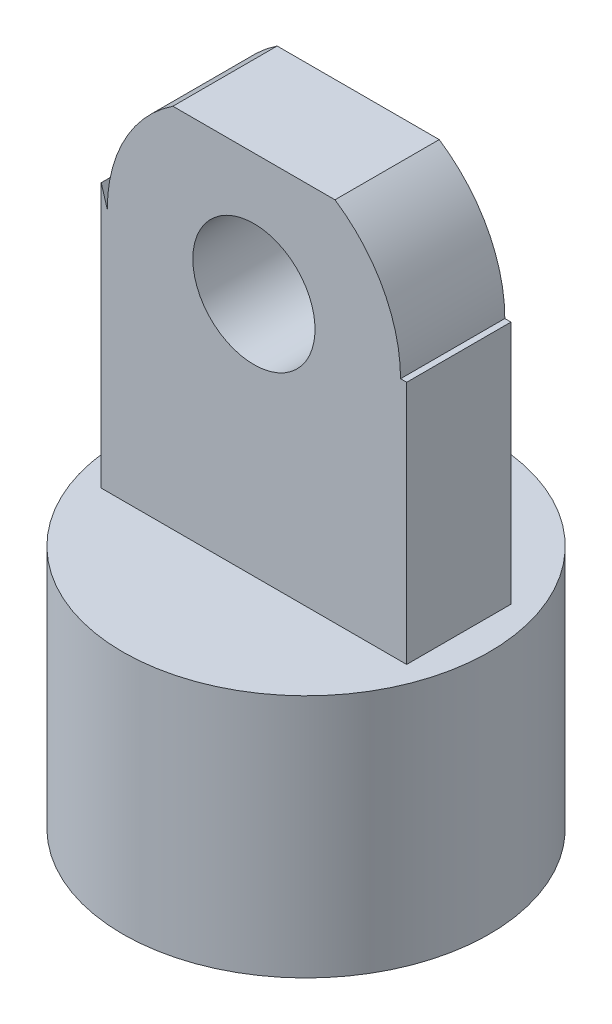
ISO-10303-21;
HEADER;
FILE_DESCRIPTION(('STEP AP214'),'2;1');
FILE_NAME('part.step','',(''),(''),'','','');
FILE_SCHEMA(('AUTOMOTIVE_DESIGN { 1 0 10303 214 1 1 1 1 }'));
ENDSEC;
DATA;
#1=APPLICATION_CONTEXT('core data for automotive mechanical design processes');
#2=APPLICATION_PROTOCOL_DEFINITION('international standard','automotive_design',2000,#1);
#3=PRODUCT_CONTEXT('',#1,'mechanical');
#4=PRODUCT('Part','Part','',(#3));
#5=PRODUCT_RELATED_PRODUCT_CATEGORY('part','',(#4));
#6=PRODUCT_DEFINITION_FORMATION('','',#4);
#7=PRODUCT_DEFINITION_CONTEXT('part definition',#1,'design');
#8=PRODUCT_DEFINITION('design','',#6,#7);
#9=PRODUCT_DEFINITION_SHAPE('','',#8);
#10=(LENGTH_UNIT() NAMED_UNIT(*) SI_UNIT(.MILLI.,.METRE.));
#11=(NAMED_UNIT(*) PLANE_ANGLE_UNIT() SI_UNIT($,.RADIAN.));
#12=(NAMED_UNIT(*) SI_UNIT($,.STERADIAN.) SOLID_ANGLE_UNIT());
#13=UNCERTAINTY_MEASURE_WITH_UNIT(LENGTH_MEASURE(1.E-05),#10,'distance_accuracy_value','');
#14=(GEOMETRIC_REPRESENTATION_CONTEXT(3) GLOBAL_UNCERTAINTY_ASSIGNED_CONTEXT((#13)) GLOBAL_UNIT_ASSIGNED_CONTEXT((#10,
#11,#12)) REPRESENTATION_CONTEXT('',''));
#15=CARTESIAN_POINT('',(0.,0.,0.));
#16=DIRECTION('',(0.,0.,1.));
#17=DIRECTION('',(1.,0.,0.));
#18=AXIS2_PLACEMENT_3D('',#15,#16,#17);
#19=CARTESIAN_POINT('',(0.,20.,0.));
#20=DIRECTION('',(0.,1.,0.));
#21=DIRECTION('',(0.,0.,1.));
#22=AXIS2_PLACEMENT_3D('',#19,#20,#21);
#23=PLANE('',#22);
#24=CARTESIAN_POINT('',(0.,20.,0.));
#25=DIRECTION('',(0.,1.,0.));
#26=DIRECTION('',(0.,0.,1.));
#27=AXIS2_PLACEMENT_3D('',#24,#25,#26);
#28=CIRCLE('',#27,15.);
#29=CARTESIAN_POINT('',(0.,20.,15.));
#30=VERTEX_POINT('',#29);
#31=EDGE_CURVE('E181',#30,#30,#28,.T.);
#32=ORIENTED_EDGE('',*,*,#31,.T.);
#33=EDGE_LOOP('',(#32));
#34=FACE_BOUND('',#33,.T.);
#35=DIRECTION('',(1.,0.,0.));
#36=VECTOR('',#35,1.);
#37=CARTESIAN_POINT('',(12.5,20.,4.26695525061405));
#38=LINE('',#37,#36);
#39=CARTESIAN_POINT('',(-12.5,20.,4.26695525061405));
#40=VERTEX_POINT('',#39);
#41=CARTESIAN_POINT('',(12.5,20.,4.26695525061405));
#42=VERTEX_POINT('',#41);
#43=EDGE_CURVE('E163',#40,#42,#38,.T.);
#44=ORIENTED_EDGE('',*,*,#43,.F.);
#45=DIRECTION('',(0.,0.,1.));
#46=VECTOR('',#45,1.);
#47=CARTESIAN_POINT('',(-12.5,20.,4.26695525061405));
#48=LINE('',#47,#46);
#49=CARTESIAN_POINT('',(-12.5,20.,-4.26695525061404));
#50=VERTEX_POINT('',#49);
#51=EDGE_CURVE('E154',#50,#40,#48,.T.);
#52=ORIENTED_EDGE('',*,*,#51,.F.);
#53=DIRECTION('',(-1.,0.,0.));
#54=VECTOR('',#53,1.);
#55=CARTESIAN_POINT('',(12.5,20.,-4.26695525061405));
#56=LINE('',#55,#54);
#57=CARTESIAN_POINT('',(12.5,20.,-4.26695525061405));
#58=VERTEX_POINT('',#57);
#59=EDGE_CURVE('E159',#58,#50,#56,.T.);
#60=ORIENTED_EDGE('',*,*,#59,.F.);
#61=DIRECTION('',(0.,0.,-1.));
#62=VECTOR('',#61,1.);
#63=CARTESIAN_POINT('',(12.5,20.,4.26695525061405));
#64=LINE('',#63,#62);
#65=EDGE_CURVE('E166',#42,#58,#64,.T.);
#66=ORIENTED_EDGE('',*,*,#65,.F.);
#67=EDGE_LOOP('',(#44,#52,#60,#66));
#68=FACE_BOUND('',#67,.T.);
#69=ADVANCED_FACE('F45',(#34,#68),#23,.T.);
#70=CARTESIAN_POINT('',(0.,20.,0.));
#71=DIRECTION('',(0.,-1.,0.));
#72=DIRECTION('',(0.,0.,-1.));
#73=AXIS2_PLACEMENT_3D('',#70,#71,#72);
#74=CYLINDRICAL_SURFACE('',#73,15.);
#75=ORIENTED_EDGE('',*,*,#31,.F.);
#76=EDGE_LOOP('',(#75));
#77=FACE_BOUND('',#76,.T.);
#78=CARTESIAN_POINT('',(0.,0.,0.));
#79=DIRECTION('',(0.,1.,0.));
#80=DIRECTION('',(0.,0.,1.));
#81=AXIS2_PLACEMENT_3D('',#78,#79,#80);
#82=CIRCLE('',#81,15.);
#83=CARTESIAN_POINT('',(0.,0.,15.));
#84=VERTEX_POINT('',#83);
#85=EDGE_CURVE('E180',#84,#84,#82,.T.);
#86=ORIENTED_EDGE('',*,*,#85,.T.);
#87=EDGE_LOOP('',(#86));
#88=FACE_BOUND('',#87,.T.);
#89=ADVANCED_FACE('F47',(#77,#88),#74,.T.);
#90=CARTESIAN_POINT('',(0.,0.,0.));
#91=DIRECTION('',(0.,1.,0.));
#92=DIRECTION('',(0.,0.,1.));
#93=AXIS2_PLACEMENT_3D('',#90,#91,#92);
#94=PLANE('',#93);
#95=CARTESIAN_POINT('',(0.,0.,0.));
#96=DIRECTION('',(0.,-1.,0.));
#97=DIRECTION('',(0.,0.,-1.));
#98=AXIS2_PLACEMENT_3D('',#95,#96,#97);
#99=CIRCLE('',#98,7.5);
#100=CARTESIAN_POINT('',(0.,0.,-7.5));
#101=VERTEX_POINT('',#100);
#102=EDGE_CURVE('E177',#101,#101,#99,.T.);
#103=ORIENTED_EDGE('',*,*,#102,.F.);
#104=EDGE_LOOP('',(#103));
#105=FACE_BOUND('',#104,.T.);
#106=ORIENTED_EDGE('',*,*,#85,.F.);
#107=EDGE_LOOP('',(#106));
#108=FACE_BOUND('',#107,.T.);
#109=ADVANCED_FACE('F188',(#105,#108),#94,.F.);
#110=CARTESIAN_POINT('',(-12.5,50.,4.26695525061405));
#111=DIRECTION('',(1.,0.,0.));
#112=DIRECTION('',(0.,0.,-1.));
#113=AXIS2_PLACEMENT_3D('',#110,#111,#112);
#114=PLANE('',#113);
#115=DIRECTION('',(0.,-1.,0.));
#116=VECTOR('',#115,1.);
#117=CARTESIAN_POINT('',(-12.5,50.,4.26695525061405));
#118=LINE('',#117,#116);
#119=CARTESIAN_POINT('',(-12.5,41.6460869681389,4.26695525061405));
#120=VERTEX_POINT('',#119);
#121=EDGE_CURVE('E175',#120,#40,#118,.T.);
#122=ORIENTED_EDGE('',*,*,#121,.F.);
#123=DIRECTION('',(0.,0.,-1.));
#124=VECTOR('',#123,1.);
#125=CARTESIAN_POINT('',(-12.5,41.6460869681389,4.26695525061405));
#126=LINE('',#125,#124);
#127=CARTESIAN_POINT('',(-12.5,41.6460869681388,-4.26695525061404));
#128=VERTEX_POINT('',#127);
#129=EDGE_CURVE('E140',#120,#128,#126,.T.);
#130=ORIENTED_EDGE('',*,*,#129,.T.);
#131=DIRECTION('',(0.,-1.,0.));
#132=VECTOR('',#131,1.);
#133=CARTESIAN_POINT('',(-12.5,50.,-4.26695525061404));
#134=LINE('',#133,#132);
#135=EDGE_CURVE('E130',#128,#50,#134,.T.);
#136=ORIENTED_EDGE('',*,*,#135,.T.);
#137=ORIENTED_EDGE('',*,*,#51,.T.);
#138=EDGE_LOOP('',(#122,#130,#136,#137));
#139=FACE_BOUND('',#138,.T.);
#140=ADVANCED_FACE('F190',(#139),#114,.F.);
#141=CARTESIAN_POINT('',(12.5,50.,4.26695525061405));
#142=DIRECTION('',(0.,0.,-1.));
#143=DIRECTION('',(-1.,0.,0.));
#144=AXIS2_PLACEMENT_3D('',#141,#142,#143);
#145=PLANE('',#144);
#146=CARTESIAN_POINT('',(0.,40.,4.26695525061405));
#147=DIRECTION('',(0.,0.,-1.));
#148=DIRECTION('',(-1.,0.,0.));
#149=AXIS2_PLACEMENT_3D('',#146,#147,#148);
#150=CIRCLE('',#149,5.00000000000001);
#151=CARTESIAN_POINT('',(-5.00000000000001,40.,4.26695525061405));
#152=VERTEX_POINT('',#151);
#153=EDGE_CURVE('E151',#152,#152,#150,.T.);
#154=ORIENTED_EDGE('',*,*,#153,.T.);
#155=EDGE_LOOP('',(#154));
#156=FACE_BOUND('',#155,.T.);
#157=DIRECTION('',(-1.,0.,0.));
#158=VECTOR('',#157,1.);
#159=CARTESIAN_POINT('',(12.5,40.,4.26695525061405));
#160=LINE('',#159,#158);
#161=CARTESIAN_POINT('',(12.5,40.,4.26695525061405));
#162=VERTEX_POINT('',#161);
#163=CARTESIAN_POINT('',(12.,40.,4.26695525061405));
#164=VERTEX_POINT('',#163);
#165=EDGE_CURVE('E145',#162,#164,#160,.T.);
#166=ORIENTED_EDGE('',*,*,#165,.T.);
#167=CARTESIAN_POINT('',(0.,40.,4.26695525061405));
#168=DIRECTION('',(0.,0.,-1.));
#169=DIRECTION('',(-1.,0.,0.));
#170=AXIS2_PLACEMENT_3D('',#167,#168,#169);
#171=CIRCLE('',#170,12.);
#172=CARTESIAN_POINT('',(6.63324958071078,50.,4.26695525061405));
#173=VERTEX_POINT('',#172);
#174=EDGE_CURVE('E138',#164,#173,#171,.F.);
#175=ORIENTED_EDGE('',*,*,#174,.T.);
#176=DIRECTION('',(1.,0.,0.));
#177=VECTOR('',#176,1.);
#178=CARTESIAN_POINT('',(12.5,50.,4.26695525061405));
#179=LINE('',#178,#177);
#180=CARTESIAN_POINT('',(-6.63324958071079,50.,4.26695525061405));
#181=VERTEX_POINT('',#180);
#182=EDGE_CURVE('E155',#181,#173,#179,.T.);
#183=ORIENTED_EDGE('',*,*,#182,.F.);
#184=CARTESIAN_POINT('',(-12.,40.,4.26695525061405));
#185=VERTEX_POINT('',#184);
#186=EDGE_CURVE('E67',#181,#185,#171,.F.);
#187=ORIENTED_EDGE('',*,*,#186,.T.);
#188=DIRECTION('',(-0.29063862201532,0.956832896274494,0.));
#189=VECTOR('',#188,1.);
#190=CARTESIAN_POINT('',(-12.7113911338508,42.3420233493628,4.26695525061405));
#191=LINE('',#190,#189);
#192=EDGE_CURVE('E115',#185,#120,#191,.T.);
#193=ORIENTED_EDGE('',*,*,#192,.T.);
#194=ORIENTED_EDGE('',*,*,#121,.T.);
#195=ORIENTED_EDGE('',*,*,#43,.T.);
#196=DIRECTION('',(0.,-1.,0.));
#197=VECTOR('',#196,1.);
#198=CARTESIAN_POINT('',(12.5,50.,4.26695525061405));
#199=LINE('',#198,#197);
#200=EDGE_CURVE('E173',#162,#42,#199,.T.);
#201=ORIENTED_EDGE('',*,*,#200,.F.);
#202=EDGE_LOOP('',(#166,#175,#183,#187,#193,#194,#195,#201));
#203=FACE_BOUND('',#202,.T.);
#204=ADVANCED_FACE('F196',(#156,#203),#145,.F.);
#205=CARTESIAN_POINT('',(12.5,50.,4.26695525061405));
#206=DIRECTION('',(-1.,0.,0.));
#207=DIRECTION('',(0.,0.,1.));
#208=AXIS2_PLACEMENT_3D('',#205,#206,#207);
#209=PLANE('',#208);
#210=DIRECTION('',(0.,-1.,0.));
#211=VECTOR('',#210,1.);
#212=CARTESIAN_POINT('',(12.5,50.,-4.26695525061405));
#213=LINE('',#212,#211);
#214=CARTESIAN_POINT('',(12.5,40.,-4.26695525061405));
#215=VERTEX_POINT('',#214);
#216=EDGE_CURVE('E171',#215,#58,#213,.T.);
#217=ORIENTED_EDGE('',*,*,#216,.F.);
#218=DIRECTION('',(0.,0.,1.));
#219=VECTOR('',#218,1.);
#220=CARTESIAN_POINT('',(12.5,40.,4.26695525061405));
#221=LINE('',#220,#219);
#222=EDGE_CURVE('E142',#215,#162,#221,.T.);
#223=ORIENTED_EDGE('',*,*,#222,.T.);
#224=ORIENTED_EDGE('',*,*,#200,.T.);
#225=ORIENTED_EDGE('',*,*,#65,.T.);
#226=EDGE_LOOP('',(#217,#223,#224,#225));
#227=FACE_BOUND('',#226,.T.);
#228=ADVANCED_FACE('F210',(#227),#209,.F.);
#229=CARTESIAN_POINT('',(12.5,50.,-4.26695525061405));
#230=DIRECTION('',(0.,0.,1.));
#231=DIRECTION('',(1.,0.,0.));
#232=AXIS2_PLACEMENT_3D('',#229,#230,#231);
#233=PLANE('',#232);
#234=CARTESIAN_POINT('',(0.,40.,-4.26695525061404));
#235=DIRECTION('',(0.,0.,-1.));
#236=DIRECTION('',(-1.,0.,0.));
#237=AXIS2_PLACEMENT_3D('',#234,#235,#236);
#238=CIRCLE('',#237,5.00000000000001);
#239=CARTESIAN_POINT('',(-5.00000000000001,40.,-4.26695525061404));
#240=VERTEX_POINT('',#239);
#241=EDGE_CURVE('E148',#240,#240,#238,.T.);
#242=ORIENTED_EDGE('',*,*,#241,.F.);
#243=EDGE_LOOP('',(#242));
#244=FACE_BOUND('',#243,.T.);
#245=DIRECTION('',(-1.,0.,0.));
#246=VECTOR('',#245,1.);
#247=CARTESIAN_POINT('',(12.5,50.,-4.26695525061405));
#248=LINE('',#247,#246);
#249=CARTESIAN_POINT('',(6.63324958071078,50.,-4.26695525061405));
#250=VERTEX_POINT('',#249);
#251=CARTESIAN_POINT('',(-6.63324958071079,50.,-4.26695525061404));
#252=VERTEX_POINT('',#251);
#253=EDGE_CURVE('E158',#250,#252,#248,.T.);
#254=ORIENTED_EDGE('',*,*,#253,.F.);
#255=CARTESIAN_POINT('',(0.,40.,-4.26695525061404));
#256=DIRECTION('',(0.,0.,1.));
#257=DIRECTION('',(-1.,0.,0.));
#258=AXIS2_PLACEMENT_3D('',#255,#256,#257);
#259=CIRCLE('',#258,12.);
#260=CARTESIAN_POINT('',(12.,40.,-4.26695525061405));
#261=VERTEX_POINT('',#260);
#262=EDGE_CURVE('E59',#261,#250,#259,.T.);
#263=ORIENTED_EDGE('',*,*,#262,.F.);
#264=DIRECTION('',(-1.,0.,0.));
#265=VECTOR('',#264,1.);
#266=CARTESIAN_POINT('',(12.,40.,-4.26695525061405));
#267=LINE('',#266,#265);
#268=EDGE_CURVE('E117',#215,#261,#267,.T.);
#269=ORIENTED_EDGE('',*,*,#268,.F.);
#270=ORIENTED_EDGE('',*,*,#216,.T.);
#271=ORIENTED_EDGE('',*,*,#59,.T.);
#272=ORIENTED_EDGE('',*,*,#135,.F.);
#273=DIRECTION('',(-0.29063862201532,0.956832896274494,0.));
#274=VECTOR('',#273,1.);
#275=CARTESIAN_POINT('',(-20.699554593314,68.6404468893329,-4.26695525061404));
#276=LINE('',#275,#274);
#277=CARTESIAN_POINT('',(-12.,40.,-4.26695525061404));
#278=VERTEX_POINT('',#277);
#279=EDGE_CURVE('E112',#278,#128,#276,.T.);
#280=ORIENTED_EDGE('',*,*,#279,.F.);
#281=EDGE_CURVE('E120',#252,#278,#259,.T.);
#282=ORIENTED_EDGE('',*,*,#281,.F.);
#283=EDGE_LOOP('',(#254,#263,#269,#270,#271,#272,#280,#282));
#284=FACE_BOUND('',#283,.T.);
#285=ADVANCED_FACE('F128',(#244,#284),#233,.F.);
#286=CARTESIAN_POINT('',(0.,50.,0.));
#287=DIRECTION('',(0.,1.,0.));
#288=DIRECTION('',(0.,0.,1.));
#289=AXIS2_PLACEMENT_3D('',#286,#287,#288);
#290=PLANE('',#289);
#291=DIRECTION('',(0.,0.,-1.));
#292=VECTOR('',#291,1.);
#293=CARTESIAN_POINT('',(6.63324958071078,50.,25.733044749386));
#294=LINE('',#293,#292);
#295=EDGE_CURVE('E13',#250,#173,#294,.F.);
#296=ORIENTED_EDGE('',*,*,#295,.F.);
#297=ORIENTED_EDGE('',*,*,#253,.T.);
#298=DIRECTION('',(0.,0.,-1.));
#299=VECTOR('',#298,1.);
#300=CARTESIAN_POINT('',(-6.63324958071079,50.,25.733044749386));
#301=LINE('',#300,#299);
#302=EDGE_CURVE('E53',#181,#252,#301,.T.);
#303=ORIENTED_EDGE('',*,*,#302,.F.);
#304=ORIENTED_EDGE('',*,*,#182,.T.);
#305=EDGE_LOOP('',(#296,#297,#303,#304));
#306=FACE_BOUND('',#305,.T.);
#307=ADVANCED_FACE('F217',(#306),#290,.T.);
#308=CARTESIAN_POINT('',(0.,40.,25.733044749386));
#309=DIRECTION('',(0.,0.,-1.));
#310=DIRECTION('',(-1.,0.,0.));
#311=AXIS2_PLACEMENT_3D('',#308,#309,#310);
#312=CYLINDRICAL_SURFACE('',#311,5.00000000000001);
#313=ORIENTED_EDGE('',*,*,#241,.T.);
#314=EDGE_LOOP('',(#313));
#315=FACE_BOUND('',#314,.T.);
#316=ORIENTED_EDGE('',*,*,#153,.F.);
#317=EDGE_LOOP('',(#316));
#318=FACE_BOUND('',#317,.T.);
#319=ADVANCED_FACE('F221',(#315,#318),#312,.F.);
#320=CARTESIAN_POINT('',(0.,40.,25.733044749386));
#321=DIRECTION('',(0.,0.,-1.));
#322=DIRECTION('',(-1.,0.,0.));
#323=AXIS2_PLACEMENT_3D('',#320,#321,#322);
#324=CYLINDRICAL_SURFACE('',#323,12.);
#325=ORIENTED_EDGE('',*,*,#302,.T.);
#326=ORIENTED_EDGE('',*,*,#281,.T.);
#327=DIRECTION('',(0.,0.,-1.));
#328=VECTOR('',#327,1.);
#329=CARTESIAN_POINT('',(-12.,40.,25.733044749386));
#330=LINE('',#329,#328);
#331=EDGE_CURVE('E108',#185,#278,#330,.T.);
#332=ORIENTED_EDGE('',*,*,#331,.F.);
#333=ORIENTED_EDGE('',*,*,#186,.F.);
#334=EDGE_LOOP('',(#325,#326,#332,#333));
#335=FACE_BOUND('',#334,.T.);
#336=ADVANCED_FACE('F121',(#335),#324,.T.);
#337=CARTESIAN_POINT('',(-20.699554593314,68.6404468893329,25.733044749386));
#338=DIRECTION('',(-0.956832896274494,-0.29063862201532,0.));
#339=DIRECTION('',(0.29063862201532,-0.956832896274494,0.));
#340=AXIS2_PLACEMENT_3D('',#337,#338,#339);
#341=PLANE('',#340);
#342=ORIENTED_EDGE('',*,*,#192,.F.);
#343=ORIENTED_EDGE('',*,*,#331,.T.);
#344=ORIENTED_EDGE('',*,*,#279,.T.);
#345=ORIENTED_EDGE('',*,*,#129,.F.);
#346=EDGE_LOOP('',(#342,#343,#344,#345));
#347=FACE_BOUND('',#346,.T.);
#348=ADVANCED_FACE('F110',(#347),#341,.F.);
#349=CARTESIAN_POINT('',(12.,40.,25.733044749386));
#350=DIRECTION('',(0.,-1.,0.));
#351=DIRECTION('',(0.,0.,-1.));
#352=AXIS2_PLACEMENT_3D('',#349,#350,#351);
#353=PLANE('',#352);
#354=ORIENTED_EDGE('',*,*,#222,.F.);
#355=ORIENTED_EDGE('',*,*,#268,.T.);
#356=DIRECTION('',(0.,0.,-1.));
#357=VECTOR('',#356,1.);
#358=CARTESIAN_POINT('',(12.,40.,25.733044749386));
#359=LINE('',#358,#357);
#360=EDGE_CURVE('E116',#164,#261,#359,.T.);
#361=ORIENTED_EDGE('',*,*,#360,.F.);
#362=ORIENTED_EDGE('',*,*,#165,.F.);
#363=EDGE_LOOP('',(#354,#355,#361,#362));
#364=FACE_BOUND('',#363,.T.);
#365=ADVANCED_FACE('F230',(#364),#353,.F.);
#366=ORIENTED_EDGE('',*,*,#360,.T.);
#367=ORIENTED_EDGE('',*,*,#262,.T.);
#368=ORIENTED_EDGE('',*,*,#295,.T.);
#369=ORIENTED_EDGE('',*,*,#174,.F.);
#370=EDGE_LOOP('',(#366,#367,#368,#369));
#371=FACE_BOUND('',#370,.T.);
#372=ADVANCED_FACE('F226',(#371),#324,.T.);
#373=CARTESIAN_POINT('',(0.,-5.,0.));
#374=DIRECTION('',(0.,1.,0.));
#375=DIRECTION('',(0.,0.,1.));
#376=AXIS2_PLACEMENT_3D('',#373,#374,#375);
#377=CYLINDRICAL_SURFACE('',#376,7.5);
#378=CARTESIAN_POINT('',(0.,-5.,0.));
#379=DIRECTION('',(0.,-1.,0.));
#380=DIRECTION('',(0.,0.,-1.));
#381=AXIS2_PLACEMENT_3D('',#378,#379,#380);
#382=CIRCLE('',#381,7.5);
#383=CARTESIAN_POINT('',(0.,-5.,-7.5));
#384=VERTEX_POINT('',#383);
#385=EDGE_CURVE('E125',#384,#384,#382,.T.);
#386=ORIENTED_EDGE('',*,*,#385,.F.);
#387=EDGE_LOOP('',(#386));
#388=FACE_BOUND('',#387,.T.);
#389=ORIENTED_EDGE('',*,*,#102,.T.);
#390=EDGE_LOOP('',(#389));
#391=FACE_BOUND('',#390,.T.);
#392=ADVANCED_FACE('F229',(#388,#391),#377,.T.);
#393=CARTESIAN_POINT('',(0.,-5.,0.));
#394=DIRECTION('',(0.,-1.,0.));
#395=DIRECTION('',(0.,0.,-1.));
#396=AXIS2_PLACEMENT_3D('',#393,#394,#395);
#397=PLANE('',#396);
#398=ORIENTED_EDGE('',*,*,#385,.T.);
#399=EDGE_LOOP('',(#398));
#400=FACE_BOUND('',#399,.T.);
#401=ADVANCED_FACE('F238',(#400),#397,.T.);
#402=CLOSED_SHELL('',(#69,#89,#109,#140,#204,#228,#285,#307,#319,#336,#348,#365,#372,#392,#401));
#403=MANIFOLD_SOLID_BREP('B2',#402);
#404=ADVANCED_BREP_SHAPE_REPRESENTATION('',(#18,#403),#14);
#405=SHAPE_DEFINITION_REPRESENTATION(#9,#404);
ENDSEC;
END-ISO-10303-21;
